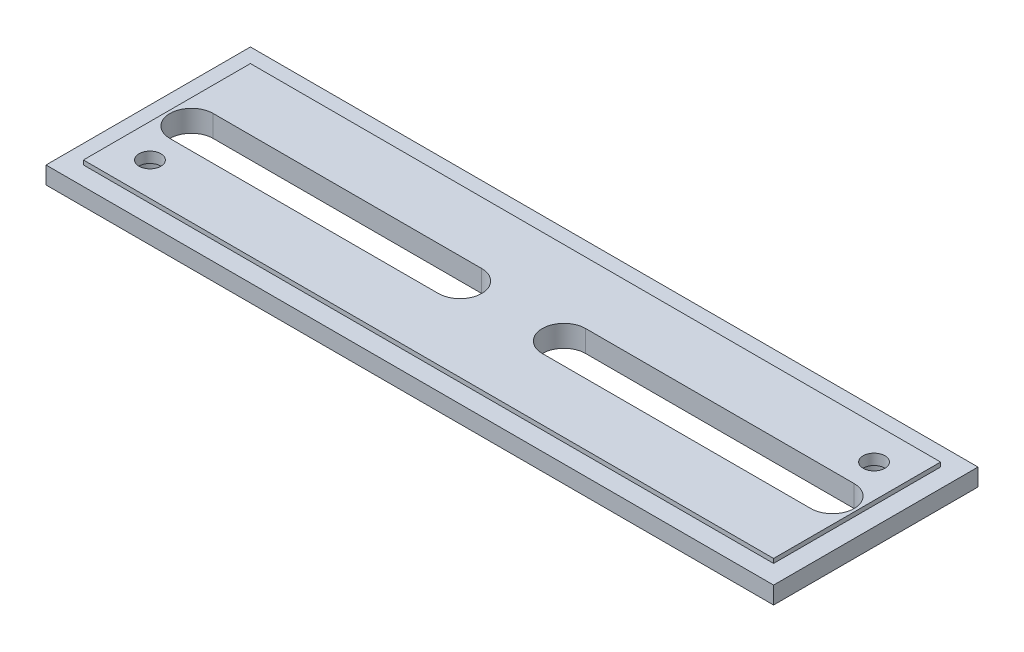
ISO-10303-21;
HEADER;
FILE_DESCRIPTION(('STEP AP214'),'2;1');
FILE_NAME('part.step','',(''),(''),'','','');
FILE_SCHEMA(('AUTOMOTIVE_DESIGN { 1 0 10303 214 1 1 1 1 }'));
ENDSEC;
DATA;
#1=APPLICATION_CONTEXT('core data for automotive mechanical design processes');
#2=APPLICATION_PROTOCOL_DEFINITION('international standard','automotive_design',2000,#1);
#3=PRODUCT_CONTEXT('',#1,'mechanical');
#4=PRODUCT('Part','Part','',(#3));
#5=PRODUCT_RELATED_PRODUCT_CATEGORY('part','',(#4));
#6=PRODUCT_DEFINITION_FORMATION('','',#4);
#7=PRODUCT_DEFINITION_CONTEXT('part definition',#1,'design');
#8=PRODUCT_DEFINITION('design','',#6,#7);
#9=PRODUCT_DEFINITION_SHAPE('','',#8);
#10=(LENGTH_UNIT() NAMED_UNIT(*) SI_UNIT(.MILLI.,.METRE.));
#11=(NAMED_UNIT(*) PLANE_ANGLE_UNIT() SI_UNIT($,.RADIAN.));
#12=(NAMED_UNIT(*) SI_UNIT($,.STERADIAN.) SOLID_ANGLE_UNIT());
#13=UNCERTAINTY_MEASURE_WITH_UNIT(LENGTH_MEASURE(1.E-05),#10,'distance_accuracy_value','');
#14=(GEOMETRIC_REPRESENTATION_CONTEXT(3) GLOBAL_UNCERTAINTY_ASSIGNED_CONTEXT((#13)) GLOBAL_UNIT_ASSIGNED_CONTEXT((#10,
#11,#12)) REPRESENTATION_CONTEXT('',''));
#15=CARTESIAN_POINT('',(0.,0.,0.));
#16=DIRECTION('',(0.,0.,1.));
#17=DIRECTION('',(1.,0.,0.));
#18=AXIS2_PLACEMENT_3D('',#15,#16,#17);
#19=CARTESIAN_POINT('',(57.15,3.96975,-9.20750000000002));
#20=DIRECTION('',(0.,-1.,0.));
#21=DIRECTION('',(0.,0.,-1.));
#22=AXIS2_PLACEMENT_3D('',#19,#20,#21);
#23=CYLINDRICAL_SURFACE('',#22,2.);
#24=CARTESIAN_POINT('',(57.15,3.96875,-9.20750000000002));
#25=DIRECTION('',(0.,-1.,0.));
#26=DIRECTION('',(0.,0.,-1.));
#27=AXIS2_PLACEMENT_3D('',#24,#25,#26);
#28=CIRCLE('',#27,2.);
#29=CARTESIAN_POINT('',(57.15,3.96875,-11.2075));
#30=VERTEX_POINT('',#29);
#31=EDGE_CURVE('E337',#30,#30,#28,.T.);
#32=ORIENTED_EDGE('',*,*,#31,.F.);
#33=EDGE_LOOP('',(#32));
#34=FACE_BOUND('',#33,.T.);
#35=CARTESIAN_POINT('',(57.15,2.,-9.20750000000002));
#36=DIRECTION('',(0.,-1.,0.));
#37=DIRECTION('',(0.,0.,-1.));
#38=AXIS2_PLACEMENT_3D('',#35,#36,#37);
#39=CIRCLE('',#38,2.);
#40=CARTESIAN_POINT('',(57.15,2.,-11.2075));
#41=VERTEX_POINT('',#40);
#42=EDGE_CURVE('E43',#41,#41,#39,.T.);
#43=ORIENTED_EDGE('',*,*,#42,.T.);
#44=EDGE_LOOP('',(#43));
#45=FACE_BOUND('',#44,.T.);
#46=ADVANCED_FACE('F39',(#34,#45),#23,.F.);
#47=CARTESIAN_POINT('',(-57.15,3.96975,9.2075));
#48=DIRECTION('',(0.,-1.,0.));
#49=DIRECTION('',(0.,0.,-1.));
#50=AXIS2_PLACEMENT_3D('',#47,#48,#49);
#51=CYLINDRICAL_SURFACE('',#50,2.);
#52=CARTESIAN_POINT('',(-57.15,3.96875,9.2075));
#53=DIRECTION('',(0.,-1.,0.));
#54=DIRECTION('',(0.,0.,-1.));
#55=AXIS2_PLACEMENT_3D('',#52,#53,#54);
#56=CIRCLE('',#55,2.);
#57=CARTESIAN_POINT('',(-57.15,3.96875,7.2075));
#58=VERTEX_POINT('',#57);
#59=EDGE_CURVE('E355',#58,#58,#56,.T.);
#60=ORIENTED_EDGE('',*,*,#59,.F.);
#61=EDGE_LOOP('',(#60));
#62=FACE_BOUND('',#61,.T.);
#63=CARTESIAN_POINT('',(-57.15,2.,9.2075));
#64=DIRECTION('',(0.,-1.,0.));
#65=DIRECTION('',(0.,0.,-1.));
#66=AXIS2_PLACEMENT_3D('',#63,#64,#65);
#67=CIRCLE('',#66,2.);
#68=CARTESIAN_POINT('',(-57.15,2.,7.2075));
#69=VERTEX_POINT('',#68);
#70=EDGE_CURVE('E328',#69,#69,#67,.T.);
#71=ORIENTED_EDGE('',*,*,#70,.T.);
#72=EDGE_LOOP('',(#71));
#73=FACE_BOUND('',#72,.T.);
#74=ADVANCED_FACE('F367',(#62,#73),#51,.F.);
#75=CARTESIAN_POINT('',(0.,0.,0.));
#76=DIRECTION('',(0.,-1.,0.));
#77=DIRECTION('',(0.,0.,-1.));
#78=AXIS2_PLACEMENT_3D('',#75,#76,#77);
#79=PLANE('',#78);
#80=CARTESIAN_POINT('',(-57.15,0.,9.2075));
#81=DIRECTION('',(0.,-1.,0.));
#82=DIRECTION('',(0.,0.,-1.));
#83=AXIS2_PLACEMENT_3D('',#80,#81,#82);
#84=CIRCLE('',#83,3.175);
#85=CARTESIAN_POINT('',(-57.15,0.,6.0325));
#86=VERTEX_POINT('',#85);
#87=EDGE_CURVE('E339',#86,#86,#84,.T.);
#88=ORIENTED_EDGE('',*,*,#87,.F.);
#89=EDGE_LOOP('',(#88));
#90=FACE_BOUND('',#89,.T.);
#91=CARTESIAN_POINT('',(57.15,0.,-9.20750000000002));
#92=DIRECTION('',(0.,-1.,0.));
#93=DIRECTION('',(0.,0.,-1.));
#94=AXIS2_PLACEMENT_3D('',#91,#92,#93);
#95=CIRCLE('',#94,3.175);
#96=CARTESIAN_POINT('',(57.15,0.,-12.3825));
#97=VERTEX_POINT('',#96);
#98=EDGE_CURVE('E351',#97,#97,#95,.T.);
#99=ORIENTED_EDGE('',*,*,#98,.F.);
#100=EDGE_LOOP('',(#99));
#101=FACE_BOUND('',#100,.T.);
#102=CARTESIAN_POINT('',(9.525,0.,0.));
#103=DIRECTION('',(0.,-1.,0.));
#104=DIRECTION('',(0.,0.,1.));
#105=AXIS2_PLACEMENT_3D('',#102,#103,#104);
#106=CIRCLE('',#105,3.96875);
#107=CARTESIAN_POINT('',(9.525,0.,3.96875));
#108=VERTEX_POINT('',#107);
#109=CARTESIAN_POINT('',(9.525,0.,-3.96875));
#110=VERTEX_POINT('',#109);
#111=EDGE_CURVE('E57',#108,#110,#106,.T.);
#112=ORIENTED_EDGE('',*,*,#111,.F.);
#113=DIRECTION('',(-1.,0.,0.));
#114=VECTOR('',#113,1.);
#115=CARTESIAN_POINT('',(9.525,0.,3.96875));
#116=LINE('',#115,#114);
#117=CARTESIAN_POINT('',(58.7375,0.,3.96875000000001));
#118=VERTEX_POINT('',#117);
#119=EDGE_CURVE('E182',#118,#108,#116,.T.);
#120=ORIENTED_EDGE('',*,*,#119,.F.);
#121=CARTESIAN_POINT('',(58.7375,0.,0.));
#122=DIRECTION('',(0.,-1.,0.));
#123=DIRECTION('',(0.,0.,1.));
#124=AXIS2_PLACEMENT_3D('',#121,#122,#123);
#125=CIRCLE('',#124,3.96875);
#126=CARTESIAN_POINT('',(58.7375,0.,-3.96874999999999));
#127=VERTEX_POINT('',#126);
#128=EDGE_CURVE('E190',#127,#118,#125,.T.);
#129=ORIENTED_EDGE('',*,*,#128,.F.);
#130=DIRECTION('',(1.,0.,0.));
#131=VECTOR('',#130,1.);
#132=CARTESIAN_POINT('',(9.525,0.,-3.96875));
#133=LINE('',#132,#131);
#134=EDGE_CURVE('E164',#110,#127,#133,.T.);
#135=ORIENTED_EDGE('',*,*,#134,.F.);
#136=EDGE_LOOP('',(#112,#120,#129,#135));
#137=FACE_BOUND('',#136,.T.);
#138=DIRECTION('',(0.,0.,-1.));
#139=VECTOR('',#138,1.);
#140=CARTESIAN_POINT('',(66.675,0.,18.7325));
#141=LINE('',#140,#139);
#142=CARTESIAN_POINT('',(66.675,0.,18.7325));
#143=VERTEX_POINT('',#142);
#144=CARTESIAN_POINT('',(66.675,0.,-18.7325));
#145=VERTEX_POINT('',#144);
#146=EDGE_CURVE('E292',#143,#145,#141,.T.);
#147=ORIENTED_EDGE('',*,*,#146,.F.);
#148=DIRECTION('',(1.,0.,0.));
#149=VECTOR('',#148,1.);
#150=CARTESIAN_POINT('',(-66.675,0.,18.7325));
#151=LINE('',#150,#149);
#152=CARTESIAN_POINT('',(-66.675,0.,18.7325));
#153=VERTEX_POINT('',#152);
#154=EDGE_CURVE('E298',#153,#143,#151,.T.);
#155=ORIENTED_EDGE('',*,*,#154,.F.);
#156=DIRECTION('',(0.,0.,1.));
#157=VECTOR('',#156,1.);
#158=CARTESIAN_POINT('',(-66.675,0.,18.7325));
#159=LINE('',#158,#157);
#160=CARTESIAN_POINT('',(-66.675,0.,-18.7325));
#161=VERTEX_POINT('',#160);
#162=EDGE_CURVE('E314',#161,#153,#159,.T.);
#163=ORIENTED_EDGE('',*,*,#162,.F.);
#164=DIRECTION('',(-1.,0.,0.));
#165=VECTOR('',#164,1.);
#166=CARTESIAN_POINT('',(-66.675,0.,-18.7325));
#167=LINE('',#166,#165);
#168=EDGE_CURVE('E311',#145,#161,#167,.T.);
#169=ORIENTED_EDGE('',*,*,#168,.F.);
#170=EDGE_LOOP('',(#147,#155,#163,#169));
#171=FACE_BOUND('',#170,.T.);
#172=DIRECTION('',(1.,0.,0.));
#173=VECTOR('',#172,1.);
#174=CARTESIAN_POINT('',(-9.525,0.,3.96875));
#175=LINE('',#174,#173);
#176=CARTESIAN_POINT('',(-58.7375,0.,3.96875000000001));
#177=VERTEX_POINT('',#176);
#178=CARTESIAN_POINT('',(-9.525,0.,3.96875));
#179=VERTEX_POINT('',#178);
#180=EDGE_CURVE('E226',#177,#179,#175,.T.);
#181=ORIENTED_EDGE('',*,*,#180,.T.);
#182=CARTESIAN_POINT('',(-9.525,0.,0.));
#183=DIRECTION('',(0.,1.,0.));
#184=DIRECTION('',(0.,0.,1.));
#185=AXIS2_PLACEMENT_3D('',#182,#183,#184);
#186=CIRCLE('',#185,3.96875);
#187=CARTESIAN_POINT('',(-9.525,0.,-3.96875));
#188=VERTEX_POINT('',#187);
#189=EDGE_CURVE('E214',#179,#188,#186,.T.);
#190=ORIENTED_EDGE('',*,*,#189,.T.);
#191=DIRECTION('',(-1.,0.,0.));
#192=VECTOR('',#191,1.);
#193=CARTESIAN_POINT('',(-9.525,0.,-3.96875));
#194=LINE('',#193,#192);
#195=CARTESIAN_POINT('',(-58.7375,0.,-3.96874999999999));
#196=VERTEX_POINT('',#195);
#197=EDGE_CURVE('E218',#188,#196,#194,.T.);
#198=ORIENTED_EDGE('',*,*,#197,.T.);
#199=CARTESIAN_POINT('',(-58.7375,0.,0.));
#200=DIRECTION('',(0.,1.,0.));
#201=DIRECTION('',(0.,0.,1.));
#202=AXIS2_PLACEMENT_3D('',#199,#200,#201);
#203=CIRCLE('',#202,3.96875);
#204=EDGE_CURVE('E222',#196,#177,#203,.T.);
#205=ORIENTED_EDGE('',*,*,#204,.T.);
#206=EDGE_LOOP('',(#181,#190,#198,#205));
#207=FACE_BOUND('',#206,.T.);
#208=ADVANCED_FACE('F384',(#90,#101,#137,#171,#207),#79,.T.);
#209=CARTESIAN_POINT('',(0.,3.96875,0.));
#210=DIRECTION('',(0.,-1.,0.));
#211=DIRECTION('',(0.,0.,-1.));
#212=AXIS2_PLACEMENT_3D('',#209,#210,#211);
#213=PLANE('',#212);
#214=ORIENTED_EDGE('',*,*,#59,.T.);
#215=EDGE_LOOP('',(#214));
#216=FACE_BOUND('',#215,.T.);
#217=ORIENTED_EDGE('',*,*,#31,.T.);
#218=EDGE_LOOP('',(#217));
#219=FACE_BOUND('',#218,.T.);
#220=DIRECTION('',(1.,0.,0.));
#221=VECTOR('',#220,1.);
#222=CARTESIAN_POINT('',(9.525,3.96875,3.96875));
#223=LINE('',#222,#221);
#224=CARTESIAN_POINT('',(9.525,3.96875,3.96875));
#225=VERTEX_POINT('',#224);
#226=CARTESIAN_POINT('',(58.7375,3.96875,3.96875000000001));
#227=VERTEX_POINT('',#226);
#228=EDGE_CURVE('E177',#225,#227,#223,.T.);
#229=ORIENTED_EDGE('',*,*,#228,.F.);
#230=CARTESIAN_POINT('',(9.525,3.96875,0.));
#231=DIRECTION('',(0.,-1.,0.));
#232=DIRECTION('',(0.,0.,-1.));
#233=AXIS2_PLACEMENT_3D('',#230,#231,#232);
#234=CIRCLE('',#233,3.96875);
#235=CARTESIAN_POINT('',(9.525,3.96875,-3.96875));
#236=VERTEX_POINT('',#235);
#237=EDGE_CURVE('E157',#236,#225,#234,.F.);
#238=ORIENTED_EDGE('',*,*,#237,.F.);
#239=DIRECTION('',(-1.,0.,0.));
#240=VECTOR('',#239,1.);
#241=CARTESIAN_POINT('',(9.525,3.96875,-3.96875));
#242=LINE('',#241,#240);
#243=CARTESIAN_POINT('',(58.7375,3.96875,-3.96874999999999));
#244=VERTEX_POINT('',#243);
#245=EDGE_CURVE('E167',#244,#236,#242,.T.);
#246=ORIENTED_EDGE('',*,*,#245,.F.);
#247=CARTESIAN_POINT('',(58.7375,3.96875,0.));
#248=DIRECTION('',(0.,-1.,0.));
#249=DIRECTION('',(0.,0.,-1.));
#250=AXIS2_PLACEMENT_3D('',#247,#248,#249);
#251=CIRCLE('',#250,3.96875);
#252=EDGE_CURVE('E65',#227,#244,#251,.F.);
#253=ORIENTED_EDGE('',*,*,#252,.F.);
#254=EDGE_LOOP('',(#229,#238,#246,#253));
#255=FACE_BOUND('',#254,.T.);
#256=DIRECTION('',(0.,0.,-1.));
#257=VECTOR('',#256,1.);
#258=CARTESIAN_POINT('',(63.246,3.96875,15.3035));
#259=LINE('',#258,#257);
#260=CARTESIAN_POINT('',(63.246,3.96875,15.3035));
#261=VERTEX_POINT('',#260);
#262=CARTESIAN_POINT('',(63.246,3.96875,-15.3035));
#263=VERTEX_POINT('',#262);
#264=EDGE_CURVE('E248',#261,#263,#259,.T.);
#265=ORIENTED_EDGE('',*,*,#264,.T.);
#266=DIRECTION('',(-1.,0.,0.));
#267=VECTOR('',#266,1.);
#268=CARTESIAN_POINT('',(-63.246,3.96875,-15.3035));
#269=LINE('',#268,#267);
#270=CARTESIAN_POINT('',(-63.246,3.96875,-15.3035));
#271=VERTEX_POINT('',#270);
#272=EDGE_CURVE('E252',#263,#271,#269,.T.);
#273=ORIENTED_EDGE('',*,*,#272,.T.);
#274=DIRECTION('',(0.,0.,1.));
#275=VECTOR('',#274,1.);
#276=CARTESIAN_POINT('',(-63.246,3.96875,15.3035));
#277=LINE('',#276,#275);
#278=CARTESIAN_POINT('',(-63.246,3.96875,15.3035));
#279=VERTEX_POINT('',#278);
#280=EDGE_CURVE('E256',#271,#279,#277,.T.);
#281=ORIENTED_EDGE('',*,*,#280,.T.);
#282=DIRECTION('',(1.,0.,0.));
#283=VECTOR('',#282,1.);
#284=CARTESIAN_POINT('',(-63.246,3.96875,15.3035));
#285=LINE('',#284,#283);
#286=EDGE_CURVE('E259',#279,#261,#285,.T.);
#287=ORIENTED_EDGE('',*,*,#286,.T.);
#288=EDGE_LOOP('',(#265,#273,#281,#287));
#289=FACE_BOUND('',#288,.T.);
#290=CARTESIAN_POINT('',(-9.525,3.96875,0.));
#291=DIRECTION('',(0.,-1.,0.));
#292=DIRECTION('',(0.,0.,-1.));
#293=AXIS2_PLACEMENT_3D('',#290,#291,#292);
#294=CIRCLE('',#293,3.96875);
#295=CARTESIAN_POINT('',(-9.525,3.96875,-3.96875));
#296=VERTEX_POINT('',#295);
#297=CARTESIAN_POINT('',(-9.525,3.96875,3.96875));
#298=VERTEX_POINT('',#297);
#299=EDGE_CURVE('E210',#296,#298,#294,.T.);
#300=ORIENTED_EDGE('',*,*,#299,.T.);
#301=DIRECTION('',(-1.,0.,0.));
#302=VECTOR('',#301,1.);
#303=CARTESIAN_POINT('',(-9.525,3.96875,3.96875));
#304=LINE('',#303,#302);
#305=CARTESIAN_POINT('',(-58.7375,3.96875,3.96875000000001));
#306=VERTEX_POINT('',#305);
#307=EDGE_CURVE('E243',#298,#306,#304,.T.);
#308=ORIENTED_EDGE('',*,*,#307,.T.);
#309=CARTESIAN_POINT('',(-58.7375,3.96875,0.));
#310=DIRECTION('',(0.,-1.,0.));
#311=DIRECTION('',(0.,0.,-1.));
#312=AXIS2_PLACEMENT_3D('',#309,#310,#311);
#313=CIRCLE('',#312,3.96875);
#314=CARTESIAN_POINT('',(-58.7375,3.96875,-3.96874999999999));
#315=VERTEX_POINT('',#314);
#316=EDGE_CURVE('E171',#306,#315,#313,.T.);
#317=ORIENTED_EDGE('',*,*,#316,.T.);
#318=DIRECTION('',(1.,0.,0.));
#319=VECTOR('',#318,1.);
#320=CARTESIAN_POINT('',(-9.525,3.96875,-3.96875));
#321=LINE('',#320,#319);
#322=EDGE_CURVE('E206',#315,#296,#321,.T.);
#323=ORIENTED_EDGE('',*,*,#322,.T.);
#324=EDGE_LOOP('',(#300,#308,#317,#323));
#325=FACE_BOUND('',#324,.T.);
#326=ADVANCED_FACE('F174',(#216,#219,#255,#289,#325),#213,.F.);
#327=CARTESIAN_POINT('',(0.,3.175,0.));
#328=DIRECTION('',(0.,-1.,0.));
#329=DIRECTION('',(0.,0.,-1.));
#330=AXIS2_PLACEMENT_3D('',#327,#328,#329);
#331=PLANE('',#330);
#332=DIRECTION('',(0.,0.,-1.));
#333=VECTOR('',#332,1.);
#334=CARTESIAN_POINT('',(66.675,3.175,18.7325));
#335=LINE('',#334,#333);
#336=CARTESIAN_POINT('',(66.675,3.175,18.7325));
#337=VERTEX_POINT('',#336);
#338=CARTESIAN_POINT('',(66.675,3.175,-18.7325));
#339=VERTEX_POINT('',#338);
#340=EDGE_CURVE('E293',#337,#339,#335,.T.);
#341=ORIENTED_EDGE('',*,*,#340,.T.);
#342=DIRECTION('',(-1.,0.,0.));
#343=VECTOR('',#342,1.);
#344=CARTESIAN_POINT('',(-66.675,3.175,-18.7325));
#345=LINE('',#344,#343);
#346=CARTESIAN_POINT('',(-66.675,3.175,-18.7325));
#347=VERTEX_POINT('',#346);
#348=EDGE_CURVE('E297',#339,#347,#345,.T.);
#349=ORIENTED_EDGE('',*,*,#348,.T.);
#350=DIRECTION('',(0.,0.,1.));
#351=VECTOR('',#350,1.);
#352=CARTESIAN_POINT('',(-66.675,3.175,18.7325));
#353=LINE('',#352,#351);
#354=CARTESIAN_POINT('',(-66.675,3.175,18.7325));
#355=VERTEX_POINT('',#354);
#356=EDGE_CURVE('E301',#347,#355,#353,.T.);
#357=ORIENTED_EDGE('',*,*,#356,.T.);
#358=DIRECTION('',(1.,0.,0.));
#359=VECTOR('',#358,1.);
#360=CARTESIAN_POINT('',(-66.675,3.175,18.7325));
#361=LINE('',#360,#359);
#362=EDGE_CURVE('E304',#355,#337,#361,.T.);
#363=ORIENTED_EDGE('',*,*,#362,.T.);
#364=EDGE_LOOP('',(#341,#349,#357,#363));
#365=FACE_BOUND('',#364,.T.);
#366=DIRECTION('',(0.,0.,-1.));
#367=VECTOR('',#366,1.);
#368=CARTESIAN_POINT('',(63.246,3.175,15.3035));
#369=LINE('',#368,#367);
#370=CARTESIAN_POINT('',(63.246,3.175,15.3035));
#371=VERTEX_POINT('',#370);
#372=CARTESIAN_POINT('',(63.246,3.175,-15.3035));
#373=VERTEX_POINT('',#372);
#374=EDGE_CURVE('E247',#371,#373,#369,.T.);
#375=ORIENTED_EDGE('',*,*,#374,.F.);
#376=DIRECTION('',(1.,0.,0.));
#377=VECTOR('',#376,1.);
#378=CARTESIAN_POINT('',(-63.246,3.175,15.3035));
#379=LINE('',#378,#377);
#380=CARTESIAN_POINT('',(-63.246,3.175,15.3035));
#381=VERTEX_POINT('',#380);
#382=EDGE_CURVE('E253',#381,#371,#379,.T.);
#383=ORIENTED_EDGE('',*,*,#382,.F.);
#384=DIRECTION('',(0.,0.,1.));
#385=VECTOR('',#384,1.);
#386=CARTESIAN_POINT('',(-63.246,3.175,15.3035));
#387=LINE('',#386,#385);
#388=CARTESIAN_POINT('',(-63.246,3.175,-15.3035));
#389=VERTEX_POINT('',#388);
#390=EDGE_CURVE('E270',#389,#381,#387,.T.);
#391=ORIENTED_EDGE('',*,*,#390,.F.);
#392=DIRECTION('',(-1.,0.,0.));
#393=VECTOR('',#392,1.);
#394=CARTESIAN_POINT('',(-63.246,3.175,-15.3035));
#395=LINE('',#394,#393);
#396=EDGE_CURVE('E266',#373,#389,#395,.T.);
#397=ORIENTED_EDGE('',*,*,#396,.F.);
#398=EDGE_LOOP('',(#375,#383,#391,#397));
#399=FACE_BOUND('',#398,.T.);
#400=ADVANCED_FACE('F425',(#365,#399),#331,.F.);
#401=CARTESIAN_POINT('',(66.675,3.175,18.7325));
#402=DIRECTION('',(-1.,0.,0.));
#403=DIRECTION('',(0.,0.,1.));
#404=AXIS2_PLACEMENT_3D('',#401,#402,#403);
#405=PLANE('',#404);
#406=ORIENTED_EDGE('',*,*,#146,.T.);
#407=DIRECTION('',(0.,-1.,0.));
#408=VECTOR('',#407,1.);
#409=CARTESIAN_POINT('',(66.675,3.175,-18.7325));
#410=LINE('',#409,#408);
#411=EDGE_CURVE('E11',#339,#145,#410,.T.);
#412=ORIENTED_EDGE('',*,*,#411,.F.);
#413=ORIENTED_EDGE('',*,*,#340,.F.);
#414=DIRECTION('',(0.,-1.,0.));
#415=VECTOR('',#414,1.);
#416=CARTESIAN_POINT('',(66.675,3.175,18.7325));
#417=LINE('',#416,#415);
#418=EDGE_CURVE('E307',#337,#143,#417,.T.);
#419=ORIENTED_EDGE('',*,*,#418,.T.);
#420=EDGE_LOOP('',(#406,#412,#413,#419));
#421=FACE_BOUND('',#420,.T.);
#422=ADVANCED_FACE('F41',(#421),#405,.F.);
#423=CARTESIAN_POINT('',(-66.675,3.175,-18.7325));
#424=DIRECTION('',(0.,0.,1.));
#425=DIRECTION('',(1.,0.,0.));
#426=AXIS2_PLACEMENT_3D('',#423,#424,#425);
#427=PLANE('',#426);
#428=ORIENTED_EDGE('',*,*,#168,.T.);
#429=DIRECTION('',(0.,-1.,0.));
#430=VECTOR('',#429,1.);
#431=CARTESIAN_POINT('',(-66.675,3.175,-18.7325));
#432=LINE('',#431,#430);
#433=EDGE_CURVE('E49',#347,#161,#432,.T.);
#434=ORIENTED_EDGE('',*,*,#433,.F.);
#435=ORIENTED_EDGE('',*,*,#348,.F.);
#436=ORIENTED_EDGE('',*,*,#411,.T.);
#437=EDGE_LOOP('',(#428,#434,#435,#436));
#438=FACE_BOUND('',#437,.T.);
#439=ADVANCED_FACE('F451',(#438),#427,.F.);
#440=CARTESIAN_POINT('',(-66.675,3.175,18.7325));
#441=DIRECTION('',(1.,0.,0.));
#442=DIRECTION('',(0.,0.,-1.));
#443=AXIS2_PLACEMENT_3D('',#440,#441,#442);
#444=PLANE('',#443);
#445=ORIENTED_EDGE('',*,*,#162,.T.);
#446=DIRECTION('',(0.,-1.,0.));
#447=VECTOR('',#446,1.);
#448=CARTESIAN_POINT('',(-66.675,3.175,18.7325));
#449=LINE('',#448,#447);
#450=EDGE_CURVE('E322',#355,#153,#449,.T.);
#451=ORIENTED_EDGE('',*,*,#450,.F.);
#452=ORIENTED_EDGE('',*,*,#356,.F.);
#453=ORIENTED_EDGE('',*,*,#433,.T.);
#454=EDGE_LOOP('',(#445,#451,#452,#453));
#455=FACE_BOUND('',#454,.T.);
#456=ADVANCED_FACE('F448',(#455),#444,.F.);
#457=CARTESIAN_POINT('',(-66.675,3.175,18.7325));
#458=DIRECTION('',(0.,0.,-1.));
#459=DIRECTION('',(-1.,0.,0.));
#460=AXIS2_PLACEMENT_3D('',#457,#458,#459);
#461=PLANE('',#460);
#462=ORIENTED_EDGE('',*,*,#154,.T.);
#463=ORIENTED_EDGE('',*,*,#418,.F.);
#464=ORIENTED_EDGE('',*,*,#362,.F.);
#465=ORIENTED_EDGE('',*,*,#450,.T.);
#466=EDGE_LOOP('',(#462,#463,#464,#465));
#467=FACE_BOUND('',#466,.T.);
#468=ADVANCED_FACE('F441',(#467),#461,.F.);
#469=CARTESIAN_POINT('',(63.246,3.96875,15.3035));
#470=DIRECTION('',(-1.,0.,0.));
#471=DIRECTION('',(0.,0.,1.));
#472=AXIS2_PLACEMENT_3D('',#469,#470,#471);
#473=PLANE('',#472);
#474=ORIENTED_EDGE('',*,*,#374,.T.);
#475=DIRECTION('',(0.,-1.,0.));
#476=VECTOR('',#475,1.);
#477=CARTESIAN_POINT('',(63.246,3.96875,-15.3035));
#478=LINE('',#477,#476);
#479=EDGE_CURVE('E288',#263,#373,#478,.T.);
#480=ORIENTED_EDGE('',*,*,#479,.F.);
#481=ORIENTED_EDGE('',*,*,#264,.F.);
#482=DIRECTION('',(0.,-1.,0.));
#483=VECTOR('',#482,1.);
#484=CARTESIAN_POINT('',(63.246,3.96875,15.3035));
#485=LINE('',#484,#483);
#486=EDGE_CURVE('E262',#261,#371,#485,.T.);
#487=ORIENTED_EDGE('',*,*,#486,.T.);
#488=EDGE_LOOP('',(#474,#480,#481,#487));
#489=FACE_BOUND('',#488,.T.);
#490=ADVANCED_FACE('F437',(#489),#473,.F.);
#491=CARTESIAN_POINT('',(-63.246,3.96875,-15.3035));
#492=DIRECTION('',(0.,0.,1.));
#493=DIRECTION('',(1.,0.,0.));
#494=AXIS2_PLACEMENT_3D('',#491,#492,#493);
#495=PLANE('',#494);
#496=ORIENTED_EDGE('',*,*,#396,.T.);
#497=DIRECTION('',(0.,-1.,0.));
#498=VECTOR('',#497,1.);
#499=CARTESIAN_POINT('',(-63.246,3.96875,-15.3035));
#500=LINE('',#499,#498);
#501=EDGE_CURVE('E284',#271,#389,#500,.T.);
#502=ORIENTED_EDGE('',*,*,#501,.F.);
#503=ORIENTED_EDGE('',*,*,#272,.F.);
#504=ORIENTED_EDGE('',*,*,#479,.T.);
#505=EDGE_LOOP('',(#496,#502,#503,#504));
#506=FACE_BOUND('',#505,.T.);
#507=ADVANCED_FACE('F433',(#506),#495,.F.);
#508=CARTESIAN_POINT('',(-63.246,3.96875,15.3035));
#509=DIRECTION('',(1.,0.,0.));
#510=DIRECTION('',(0.,0.,-1.));
#511=AXIS2_PLACEMENT_3D('',#508,#509,#510);
#512=PLANE('',#511);
#513=ORIENTED_EDGE('',*,*,#390,.T.);
#514=DIRECTION('',(0.,-1.,0.));
#515=VECTOR('',#514,1.);
#516=CARTESIAN_POINT('',(-63.246,3.96875,15.3035));
#517=LINE('',#516,#515);
#518=EDGE_CURVE('E280',#279,#381,#517,.T.);
#519=ORIENTED_EDGE('',*,*,#518,.F.);
#520=ORIENTED_EDGE('',*,*,#280,.F.);
#521=ORIENTED_EDGE('',*,*,#501,.T.);
#522=EDGE_LOOP('',(#513,#519,#520,#521));
#523=FACE_BOUND('',#522,.T.);
#524=ADVANCED_FACE('F429',(#523),#512,.F.);
#525=CARTESIAN_POINT('',(-63.246,3.96875,15.3035));
#526=DIRECTION('',(0.,0.,-1.));
#527=DIRECTION('',(-1.,0.,0.));
#528=AXIS2_PLACEMENT_3D('',#525,#526,#527);
#529=PLANE('',#528);
#530=ORIENTED_EDGE('',*,*,#382,.T.);
#531=ORIENTED_EDGE('',*,*,#486,.F.);
#532=ORIENTED_EDGE('',*,*,#286,.F.);
#533=ORIENTED_EDGE('',*,*,#518,.T.);
#534=EDGE_LOOP('',(#530,#531,#532,#533));
#535=FACE_BOUND('',#534,.T.);
#536=ADVANCED_FACE('F422',(#535),#529,.F.);
#537=CARTESIAN_POINT('',(-9.525,3.96975,0.));
#538=DIRECTION('',(0.,-1.,0.));
#539=DIRECTION('',(0.,0.,-1.));
#540=AXIS2_PLACEMENT_3D('',#537,#538,#539);
#541=CYLINDRICAL_SURFACE('',#540,3.96875);
#542=DIRECTION('',(0.,-1.,0.));
#543=VECTOR('',#542,1.);
#544=CARTESIAN_POINT('',(-9.525,3.96975,-3.96875));
#545=LINE('',#544,#543);
#546=EDGE_CURVE('E240',#296,#188,#545,.T.);
#547=ORIENTED_EDGE('',*,*,#546,.T.);
#548=ORIENTED_EDGE('',*,*,#189,.F.);
#549=DIRECTION('',(0.,-1.,0.));
#550=VECTOR('',#549,1.);
#551=CARTESIAN_POINT('',(-9.525,3.96975,3.96875));
#552=LINE('',#551,#550);
#553=EDGE_CURVE('E230',#298,#179,#552,.T.);
#554=ORIENTED_EDGE('',*,*,#553,.F.);
#555=ORIENTED_EDGE('',*,*,#299,.F.);
#556=EDGE_LOOP('',(#547,#548,#554,#555));
#557=FACE_BOUND('',#556,.T.);
#558=ADVANCED_FACE('F401',(#557),#541,.F.);
#559=CARTESIAN_POINT('',(-9.525,3.96975,-3.96875));
#560=DIRECTION('',(0.,0.,1.));
#561=DIRECTION('',(1.,0.,0.));
#562=AXIS2_PLACEMENT_3D('',#559,#560,#561);
#563=PLANE('',#562);
#564=DIRECTION('',(0.,-1.,0.));
#565=VECTOR('',#564,1.);
#566=CARTESIAN_POINT('',(-58.7375,3.96975,-3.96874999999999));
#567=LINE('',#566,#565);
#568=EDGE_CURVE('E237',#315,#196,#567,.T.);
#569=ORIENTED_EDGE('',*,*,#568,.T.);
#570=ORIENTED_EDGE('',*,*,#197,.F.);
#571=ORIENTED_EDGE('',*,*,#546,.F.);
#572=ORIENTED_EDGE('',*,*,#322,.F.);
#573=EDGE_LOOP('',(#569,#570,#571,#572));
#574=FACE_BOUND('',#573,.T.);
#575=ADVANCED_FACE('F406',(#574),#563,.T.);
#576=CARTESIAN_POINT('',(-58.7375,3.96975,0.));
#577=DIRECTION('',(0.,-1.,0.));
#578=DIRECTION('',(0.,0.,-1.));
#579=AXIS2_PLACEMENT_3D('',#576,#577,#578);
#580=CYLINDRICAL_SURFACE('',#579,3.96875);
#581=DIRECTION('',(0.,-1.,0.));
#582=VECTOR('',#581,1.);
#583=CARTESIAN_POINT('',(-58.7375,3.96975,3.96875000000001));
#584=LINE('',#583,#582);
#585=EDGE_CURVE('E234',#306,#177,#584,.T.);
#586=ORIENTED_EDGE('',*,*,#585,.T.);
#587=ORIENTED_EDGE('',*,*,#204,.F.);
#588=ORIENTED_EDGE('',*,*,#568,.F.);
#589=ORIENTED_EDGE('',*,*,#316,.F.);
#590=EDGE_LOOP('',(#586,#587,#588,#589));
#591=FACE_BOUND('',#590,.T.);
#592=ADVANCED_FACE('F409',(#591),#580,.F.);
#593=CARTESIAN_POINT('',(-9.525,3.96975,3.96875));
#594=DIRECTION('',(0.,0.,-1.));
#595=DIRECTION('',(-1.,0.,0.));
#596=AXIS2_PLACEMENT_3D('',#593,#594,#595);
#597=PLANE('',#596);
#598=ORIENTED_EDGE('',*,*,#553,.T.);
#599=ORIENTED_EDGE('',*,*,#180,.F.);
#600=ORIENTED_EDGE('',*,*,#585,.F.);
#601=ORIENTED_EDGE('',*,*,#307,.F.);
#602=EDGE_LOOP('',(#598,#599,#600,#601));
#603=FACE_BOUND('',#602,.T.);
#604=ADVANCED_FACE('F397',(#603),#597,.T.);
#605=CARTESIAN_POINT('',(9.525,3.96975,0.));
#606=DIRECTION('',(0.,-1.,0.));
#607=DIRECTION('',(0.,0.,-1.));
#608=AXIS2_PLACEMENT_3D('',#605,#606,#607);
#609=CYLINDRICAL_SURFACE('',#608,3.96875);
#610=ORIENTED_EDGE('',*,*,#237,.T.);
#611=DIRECTION('',(0.,-1.,0.));
#612=VECTOR('',#611,1.);
#613=CARTESIAN_POINT('',(9.525,3.96975,3.96875));
#614=LINE('',#613,#612);
#615=EDGE_CURVE('E172',#225,#108,#614,.T.);
#616=ORIENTED_EDGE('',*,*,#615,.T.);
#617=ORIENTED_EDGE('',*,*,#111,.T.);
#618=DIRECTION('',(0.,-1.,0.));
#619=VECTOR('',#618,1.);
#620=CARTESIAN_POINT('',(9.525,3.96975,-3.96875));
#621=LINE('',#620,#619);
#622=EDGE_CURVE('E153',#236,#110,#621,.T.);
#623=ORIENTED_EDGE('',*,*,#622,.F.);
#624=EDGE_LOOP('',(#610,#616,#617,#623));
#625=FACE_BOUND('',#624,.T.);
#626=ADVANCED_FACE('F155',(#625),#609,.F.);
#627=CARTESIAN_POINT('',(9.525,3.96975,3.96875));
#628=DIRECTION('',(0.,0.,1.));
#629=DIRECTION('',(1.,0.,0.));
#630=AXIS2_PLACEMENT_3D('',#627,#628,#629);
#631=PLANE('',#630);
#632=ORIENTED_EDGE('',*,*,#228,.T.);
#633=DIRECTION('',(0.,-1.,0.));
#634=VECTOR('',#633,1.);
#635=CARTESIAN_POINT('',(58.7375,3.96975,3.96875000000001));
#636=LINE('',#635,#634);
#637=EDGE_CURVE('E198',#227,#118,#636,.T.);
#638=ORIENTED_EDGE('',*,*,#637,.T.);
#639=ORIENTED_EDGE('',*,*,#119,.T.);
#640=ORIENTED_EDGE('',*,*,#615,.F.);
#641=EDGE_LOOP('',(#632,#638,#639,#640));
#642=FACE_BOUND('',#641,.T.);
#643=ADVANCED_FACE('F555',(#642),#631,.F.);
#644=CARTESIAN_POINT('',(58.7375,3.96975,0.));
#645=DIRECTION('',(0.,-1.,0.));
#646=DIRECTION('',(0.,0.,-1.));
#647=AXIS2_PLACEMENT_3D('',#644,#645,#646);
#648=CYLINDRICAL_SURFACE('',#647,3.96875);
#649=ORIENTED_EDGE('',*,*,#252,.T.);
#650=DIRECTION('',(0.,-1.,0.));
#651=VECTOR('',#650,1.);
#652=CARTESIAN_POINT('',(58.7375,3.96975,-3.96874999999999));
#653=LINE('',#652,#651);
#654=EDGE_CURVE('E163',#244,#127,#653,.T.);
#655=ORIENTED_EDGE('',*,*,#654,.T.);
#656=ORIENTED_EDGE('',*,*,#128,.T.);
#657=ORIENTED_EDGE('',*,*,#637,.F.);
#658=EDGE_LOOP('',(#649,#655,#656,#657));
#659=FACE_BOUND('',#658,.T.);
#660=ADVANCED_FACE('F563',(#659),#648,.F.);
#661=CARTESIAN_POINT('',(9.525,3.96975,-3.96875));
#662=DIRECTION('',(0.,0.,-1.));
#663=DIRECTION('',(-1.,0.,0.));
#664=AXIS2_PLACEMENT_3D('',#661,#662,#663);
#665=PLANE('',#664);
#666=ORIENTED_EDGE('',*,*,#245,.T.);
#667=ORIENTED_EDGE('',*,*,#622,.T.);
#668=ORIENTED_EDGE('',*,*,#134,.T.);
#669=ORIENTED_EDGE('',*,*,#654,.F.);
#670=EDGE_LOOP('',(#666,#667,#668,#669));
#671=FACE_BOUND('',#670,.T.);
#672=ADVANCED_FACE('F168',(#671),#665,.F.);
#673=CARTESIAN_POINT('',(-57.15,2.,9.2075));
#674=DIRECTION('',(0.,-1.,0.));
#675=DIRECTION('',(0.,0.,-1.));
#676=AXIS2_PLACEMENT_3D('',#673,#674,#675);
#677=CYLINDRICAL_SURFACE('',#676,3.175);
#678=CARTESIAN_POINT('',(-57.15,2.,9.2075));
#679=DIRECTION('',(0.,-1.,0.));
#680=DIRECTION('',(0.,0.,-1.));
#681=AXIS2_PLACEMENT_3D('',#678,#679,#680);
#682=CIRCLE('',#681,3.175);
#683=CARTESIAN_POINT('',(-57.15,2.,6.0325));
#684=VERTEX_POINT('',#683);
#685=EDGE_CURVE('E331',#684,#684,#682,.T.);
#686=ORIENTED_EDGE('',*,*,#685,.F.);
#687=EDGE_LOOP('',(#686));
#688=FACE_BOUND('',#687,.T.);
#689=ORIENTED_EDGE('',*,*,#87,.T.);
#690=EDGE_LOOP('',(#689));
#691=FACE_BOUND('',#690,.T.);
#692=ADVANCED_FACE('F581',(#688,#691),#677,.F.);
#693=CARTESIAN_POINT('',(-57.15,2.,9.2075));
#694=DIRECTION('',(0.,-1.,0.));
#695=DIRECTION('',(0.,0.,-1.));
#696=AXIS2_PLACEMENT_3D('',#693,#694,#695);
#697=PLANE('',#696);
#698=ORIENTED_EDGE('',*,*,#70,.F.);
#699=EDGE_LOOP('',(#698));
#700=FACE_BOUND('',#699,.T.);
#701=ORIENTED_EDGE('',*,*,#685,.T.);
#702=EDGE_LOOP('',(#701));
#703=FACE_BOUND('',#702,.T.);
#704=ADVANCED_FACE('F380',(#700,#703),#697,.T.);
#705=CARTESIAN_POINT('',(57.15,2.,-9.20750000000002));
#706=DIRECTION('',(0.,-1.,0.));
#707=DIRECTION('',(0.,0.,-1.));
#708=AXIS2_PLACEMENT_3D('',#705,#706,#707);
#709=CYLINDRICAL_SURFACE('',#708,3.175);
#710=CARTESIAN_POINT('',(57.15,2.,-9.20750000000002));
#711=DIRECTION('',(0.,-1.,0.));
#712=DIRECTION('',(0.,0.,-1.));
#713=AXIS2_PLACEMENT_3D('',#710,#711,#712);
#714=CIRCLE('',#713,3.175);
#715=CARTESIAN_POINT('',(57.15,2.,-12.3825));
#716=VERTEX_POINT('',#715);
#717=EDGE_CURVE('E345',#716,#716,#714,.T.);
#718=ORIENTED_EDGE('',*,*,#717,.F.);
#719=EDGE_LOOP('',(#718));
#720=FACE_BOUND('',#719,.T.);
#721=ORIENTED_EDGE('',*,*,#98,.T.);
#722=EDGE_LOOP('',(#721));
#723=FACE_BOUND('',#722,.T.);
#724=ADVANCED_FACE('F374',(#720,#723),#709,.F.);
#725=CARTESIAN_POINT('',(57.15,2.,-9.20750000000002));
#726=DIRECTION('',(0.,-1.,0.));
#727=DIRECTION('',(0.,0.,-1.));
#728=AXIS2_PLACEMENT_3D('',#725,#726,#727);
#729=PLANE('',#728);
#730=ORIENTED_EDGE('',*,*,#42,.F.);
#731=EDGE_LOOP('',(#730));
#732=FACE_BOUND('',#731,.T.);
#733=ORIENTED_EDGE('',*,*,#717,.T.);
#734=EDGE_LOOP('',(#733));
#735=FACE_BOUND('',#734,.T.);
#736=ADVANCED_FACE('F371',(#732,#735),#729,.T.);
#737=CLOSED_SHELL('',(#46,#74,#208,#326,#400,#422,#439,#456,#468,#490,#507,#524,#536,#558,#575,
#592,#604,#626,#643,#660,#672,#692,#704,#724,#736));
#738=MANIFOLD_SOLID_BREP('B2',#737);
#739=ADVANCED_BREP_SHAPE_REPRESENTATION('',(#18,#738),#14);
#740=SHAPE_DEFINITION_REPRESENTATION(#9,#739);
ENDSEC;
END-ISO-10303-21;
